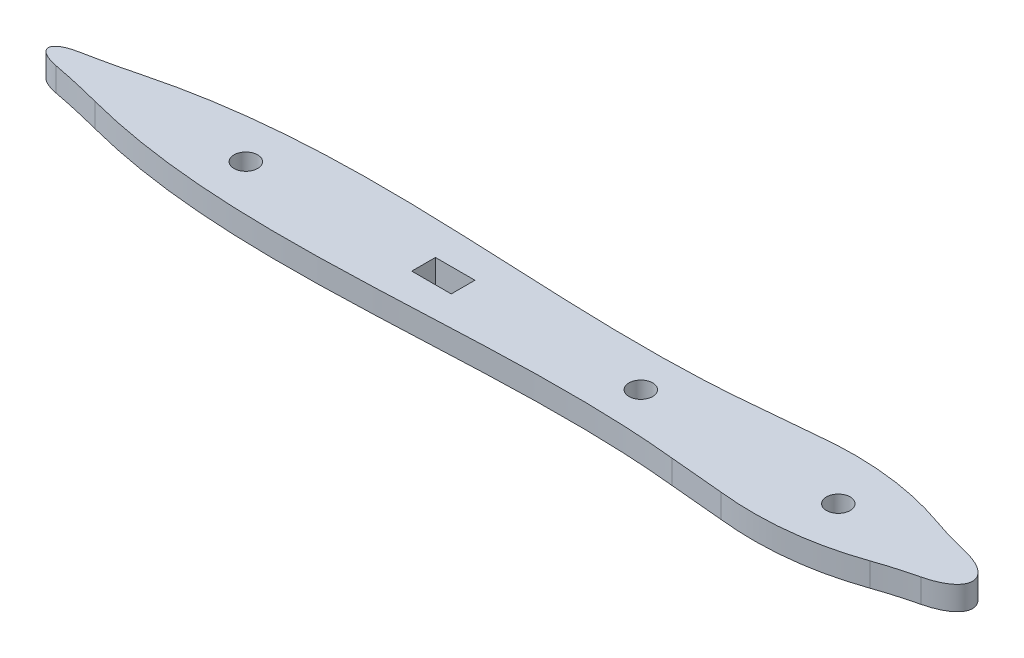
ISO-10303-21;
HEADER;
FILE_DESCRIPTION(('STEP AP214'),'2;1');
FILE_NAME('part.step','',(''),(''),'','','');
FILE_SCHEMA(('AUTOMOTIVE_DESIGN { 1 0 10303 214 1 1 1 1 }'));
ENDSEC;
DATA;
#1=APPLICATION_CONTEXT('core data for automotive mechanical design processes');
#2=APPLICATION_PROTOCOL_DEFINITION('international standard','automotive_design',2000,#1);
#3=PRODUCT_CONTEXT('',#1,'mechanical');
#4=PRODUCT('Part','Part','',(#3));
#5=PRODUCT_RELATED_PRODUCT_CATEGORY('part','',(#4));
#6=PRODUCT_DEFINITION_FORMATION('','',#4);
#7=PRODUCT_DEFINITION_CONTEXT('part definition',#1,'design');
#8=PRODUCT_DEFINITION('design','',#6,#7);
#9=PRODUCT_DEFINITION_SHAPE('','',#8);
#10=(LENGTH_UNIT() NAMED_UNIT(*) SI_UNIT(.MILLI.,.METRE.));
#11=(NAMED_UNIT(*) PLANE_ANGLE_UNIT() SI_UNIT($,.RADIAN.));
#12=(NAMED_UNIT(*) SI_UNIT($,.STERADIAN.) SOLID_ANGLE_UNIT());
#13=UNCERTAINTY_MEASURE_WITH_UNIT(LENGTH_MEASURE(1.E-05),#10,'distance_accuracy_value','');
#14=(GEOMETRIC_REPRESENTATION_CONTEXT(3) GLOBAL_UNCERTAINTY_ASSIGNED_CONTEXT((#13)) GLOBAL_UNIT_ASSIGNED_CONTEXT((#10,
#11,#12)) REPRESENTATION_CONTEXT('',''));
#15=CARTESIAN_POINT('',(0.,0.,0.));
#16=DIRECTION('',(0.,0.,1.));
#17=DIRECTION('',(1.,0.,0.));
#18=AXIS2_PLACEMENT_3D('',#15,#16,#17);
#19=CARTESIAN_POINT('',(0.,3.,-1.50000000000007));
#20=DIRECTION('',(0.,0.,1.));
#21=DIRECTION('',(1.,0.,0.));
#22=AXIS2_PLACEMENT_3D('',#19,#20,#21);
#23=PLANE('',#22);
#24=DIRECTION('',(-1.,0.,0.));
#25=VECTOR('',#24,1.);
#26=CARTESIAN_POINT('',(0.,0.,-1.50000000000007));
#27=LINE('',#26,#25);
#28=CARTESIAN_POINT('',(-47.5,0.,-1.50000000000007));
#29=VERTEX_POINT('',#28);
#30=CARTESIAN_POINT('',(-52.5,0.,-1.50000000000007));
#31=VERTEX_POINT('',#30);
#32=EDGE_CURVE('E249',#29,#31,#27,.T.);
#33=ORIENTED_EDGE('',*,*,#32,.F.);
#34=DIRECTION('',(0.,-1.,0.));
#35=VECTOR('',#34,1.);
#36=CARTESIAN_POINT('',(-47.5,3.,-1.50000000000007));
#37=LINE('',#36,#35);
#38=CARTESIAN_POINT('',(-47.5,3.,-1.50000000000007));
#39=VERTEX_POINT('',#38);
#40=EDGE_CURVE('E11',#39,#29,#37,.T.);
#41=ORIENTED_EDGE('',*,*,#40,.F.);
#42=DIRECTION('',(-1.,0.,0.));
#43=VECTOR('',#42,1.);
#44=CARTESIAN_POINT('',(0.,3.,-1.50000000000007));
#45=LINE('',#44,#43);
#46=CARTESIAN_POINT('',(-52.5,3.,-1.50000000000007));
#47=VERTEX_POINT('',#46);
#48=EDGE_CURVE('E175',#39,#47,#45,.T.);
#49=ORIENTED_EDGE('',*,*,#48,.T.);
#50=DIRECTION('',(0.,-1.,0.));
#51=VECTOR('',#50,1.);
#52=CARTESIAN_POINT('',(-52.5,3.,-1.50000000000007));
#53=LINE('',#52,#51);
#54=EDGE_CURVE('E59',#47,#31,#53,.T.);
#55=ORIENTED_EDGE('',*,*,#54,.T.);
#56=EDGE_LOOP('',(#33,#41,#49,#55));
#57=FACE_BOUND('',#56,.T.);
#58=ADVANCED_FACE('F40',(#57),#23,.T.);
#59=CARTESIAN_POINT('',(-47.5,3.,0.));
#60=DIRECTION('',(-1.,0.,0.));
#61=DIRECTION('',(0.,0.,1.));
#62=AXIS2_PLACEMENT_3D('',#59,#60,#61);
#63=PLANE('',#62);
#64=DIRECTION('',(0.,0.,-1.));
#65=VECTOR('',#64,1.);
#66=CARTESIAN_POINT('',(-47.5,0.,0.));
#67=LINE('',#66,#65);
#68=CARTESIAN_POINT('',(-47.5,0.,1.50000000000001));
#69=VERTEX_POINT('',#68);
#70=EDGE_CURVE('E164',#69,#29,#67,.T.);
#71=ORIENTED_EDGE('',*,*,#70,.F.);
#72=DIRECTION('',(0.,-1.,0.));
#73=VECTOR('',#72,1.);
#74=CARTESIAN_POINT('',(-47.5,3.,1.50000000000001));
#75=LINE('',#74,#73);
#76=CARTESIAN_POINT('',(-47.5,3.,1.50000000000001));
#77=VERTEX_POINT('',#76);
#78=EDGE_CURVE('E50',#77,#69,#75,.T.);
#79=ORIENTED_EDGE('',*,*,#78,.F.);
#80=DIRECTION('',(0.,0.,-1.));
#81=VECTOR('',#80,1.);
#82=CARTESIAN_POINT('',(-47.5,3.,0.));
#83=LINE('',#82,#81);
#84=EDGE_CURVE('E162',#77,#39,#83,.T.);
#85=ORIENTED_EDGE('',*,*,#84,.T.);
#86=ORIENTED_EDGE('',*,*,#40,.T.);
#87=EDGE_LOOP('',(#71,#79,#85,#86));
#88=FACE_BOUND('',#87,.T.);
#89=ADVANCED_FACE('F161',(#88),#63,.T.);
#90=CARTESIAN_POINT('',(0.,3.,1.50000000000001));
#91=DIRECTION('',(0.,0.,-1.));
#92=DIRECTION('',(-1.,0.,0.));
#93=AXIS2_PLACEMENT_3D('',#90,#91,#92);
#94=PLANE('',#93);
#95=DIRECTION('',(1.,0.,0.));
#96=VECTOR('',#95,1.);
#97=CARTESIAN_POINT('',(0.,0.,1.50000000000001));
#98=LINE('',#97,#96);
#99=CARTESIAN_POINT('',(-52.5,0.,1.50000000000001));
#100=VERTEX_POINT('',#99);
#101=EDGE_CURVE('E252',#100,#69,#98,.T.);
#102=ORIENTED_EDGE('',*,*,#101,.F.);
#103=DIRECTION('',(0.,-1.,0.));
#104=VECTOR('',#103,1.);
#105=CARTESIAN_POINT('',(-52.5,3.,1.50000000000001));
#106=LINE('',#105,#104);
#107=CARTESIAN_POINT('',(-52.5,3.,1.50000000000001));
#108=VERTEX_POINT('',#107);
#109=EDGE_CURVE('E108',#108,#100,#106,.T.);
#110=ORIENTED_EDGE('',*,*,#109,.F.);
#111=DIRECTION('',(1.,0.,0.));
#112=VECTOR('',#111,1.);
#113=CARTESIAN_POINT('',(0.,3.,1.50000000000001));
#114=LINE('',#113,#112);
#115=EDGE_CURVE('E174',#108,#77,#114,.T.);
#116=ORIENTED_EDGE('',*,*,#115,.T.);
#117=ORIENTED_EDGE('',*,*,#78,.T.);
#118=EDGE_LOOP('',(#102,#110,#116,#117));
#119=FACE_BOUND('',#118,.T.);
#120=ADVANCED_FACE('F177',(#119),#94,.T.);
#121=CARTESIAN_POINT('',(8.2697237420884,3.,4.25946897668879));
#122=CARTESIAN_POINT('',(2.83491324274515,3.,6.15734876027867));
#123=CARTESIAN_POINT('',(-2.82215392505471,3.,6.78752581668375));
#124=CARTESIAN_POINT('',(-8.7014778224339,3.,6.14999999999991));
#125=B_SPLINE_CURVE_WITH_KNOTS('',3,(#121,#122,#123,#124),.UNSPECIFIED.,.F.,.F.,(4,4),
(0.353889440275628,1.),.UNSPECIFIED.);
#126=DIRECTION('',(0.,-1.,0.));
#127=VECTOR('',#126,1.);
#128=SURFACE_OF_LINEAR_EXTRUSION('',#125,#127);
#129=CARTESIAN_POINT('',(8.2697237420884,0.,4.25946897668879));
#130=CARTESIAN_POINT('',(2.83491324274515,0.,6.15734876027867));
#131=CARTESIAN_POINT('',(-2.82215392505471,0.,6.78752581668375));
#132=CARTESIAN_POINT('',(-8.7014778224339,0.,6.14999999999991));
#133=B_SPLINE_CURVE_WITH_KNOTS('',3,(#129,#130,#131,#132),.UNSPECIFIED.,.F.,.F.,(4,4),
(0.353889440275628,1.),.UNSPECIFIED.);
#134=CARTESIAN_POINT('',(8.2697237420884,0.,4.25946897668879));
#135=VERTEX_POINT('',#134);
#136=CARTESIAN_POINT('',(-8.7014778224339,0.,6.14999999999991));
#137=VERTEX_POINT('',#136);
#138=EDGE_CURVE('E187',#135,#137,#133,.T.);
#139=ORIENTED_EDGE('',*,*,#138,.F.);
#140=DIRECTION('',(0.,-1.,0.));
#141=VECTOR('',#140,1.);
#142=CARTESIAN_POINT('',(8.2697237420884,3.,4.25946897668879));
#143=LINE('',#142,#141);
#144=CARTESIAN_POINT('',(8.2697237420884,3.,4.25946897668879));
#145=VERTEX_POINT('',#144);
#146=EDGE_CURVE('E44',#145,#135,#143,.T.);
#147=ORIENTED_EDGE('',*,*,#146,.F.);
#148=CARTESIAN_POINT('',(-8.7014778224339,3.,6.14999999999991));
#149=VERTEX_POINT('',#148);
#150=EDGE_CURVE('E297',#145,#149,#125,.T.);
#151=ORIENTED_EDGE('',*,*,#150,.T.);
#152=DIRECTION('',(0.,-1.,0.));
#153=VECTOR('',#152,1.);
#154=CARTESIAN_POINT('',(-8.7014778224339,3.,6.14999999999991));
#155=LINE('',#154,#153);
#156=EDGE_CURVE('E180',#149,#137,#155,.T.);
#157=ORIENTED_EDGE('',*,*,#156,.T.);
#158=EDGE_LOOP('',(#139,#147,#151,#157));
#159=FACE_BOUND('',#158,.T.);
#160=ADVANCED_FACE('F296',(#159),#128,.T.);
#161=CARTESIAN_POINT('',(24.753938545321,3.,51.4640308570935));
#162=DIRECTION('',(0.,-1.,0.));
#163=DIRECTION('',(0.,0.,-1.));
#164=AXIS2_PLACEMENT_3D('',#161,#162,#163);
#165=CYLINDRICAL_SURFACE('',#164,50.0000000000007);
#166=CARTESIAN_POINT('',(24.753938545321,0.,51.4640308570935));
#167=DIRECTION('',(0.,1.,0.));
#168=DIRECTION('',(0.,0.,1.));
#169=AXIS2_PLACEMENT_3D('',#166,#167,#168);
#170=CIRCLE('',#169,50.0000000000007);
#171=CARTESIAN_POINT('',(13.2431532591674,0.,2.80704963038625));
#172=VERTEX_POINT('',#171);
#173=EDGE_CURVE('E192',#135,#172,#170,.F.);
#174=ORIENTED_EDGE('',*,*,#173,.T.);
#175=DIRECTION('',(0.,-1.,0.));
#176=VECTOR('',#175,1.);
#177=CARTESIAN_POINT('',(13.2431532591674,3.,2.80704963038625));
#178=LINE('',#177,#176);
#179=CARTESIAN_POINT('',(13.2431532591674,3.,2.80704963038625));
#180=VERTEX_POINT('',#179);
#181=EDGE_CURVE('E282',#180,#172,#178,.T.);
#182=ORIENTED_EDGE('',*,*,#181,.F.);
#183=CARTESIAN_POINT('',(24.753938545321,3.,51.4640308570935));
#184=DIRECTION('',(0.,1.,0.));
#185=DIRECTION('',(0.,0.,1.));
#186=AXIS2_PLACEMENT_3D('',#183,#184,#185);
#187=CIRCLE('',#186,50.0000000000007);
#188=EDGE_CURVE('E290',#145,#180,#187,.F.);
#189=ORIENTED_EDGE('',*,*,#188,.F.);
#190=ORIENTED_EDGE('',*,*,#146,.T.);
#191=EDGE_LOOP('',(#174,#182,#189,#190));
#192=FACE_BOUND('',#191,.T.);
#193=ADVANCED_FACE('F288',(#192),#165,.F.);
#194=CARTESIAN_POINT('',(10.0000045781328,3.,-7.43034571371037E-07));
#195=DIRECTION('',(0.,1.,0.));
#196=DIRECTION('',(1.,0.,0.));
#197=AXIS2_PLACEMENT_3D('',#194,#195,#196);
#198=ELLIPSE('',#197,6.99999866487509,3.16752117407591);
#199=DIRECTION('',(0.,-1.,0.));
#200=VECTOR('',#199,1.);
#201=SURFACE_OF_LINEAR_EXTRUSION('',#198,#200);
#202=CARTESIAN_POINT('',(10.0000045781328,0.,-7.43034571371037E-07));
#203=DIRECTION('',(0.,1.,0.));
#204=DIRECTION('',(1.,0.,0.));
#205=AXIS2_PLACEMENT_3D('',#202,#203,#204);
#206=ELLIPSE('',#205,6.99999866487509,3.16752117407591);
#207=CARTESIAN_POINT('',(13.2431507603538,0.,-2.80705170759964));
#208=VERTEX_POINT('',#207);
#209=EDGE_CURVE('E198',#172,#208,#206,.T.);
#210=ORIENTED_EDGE('',*,*,#209,.T.);
#211=DIRECTION('',(0.,-1.,0.));
#212=VECTOR('',#211,1.);
#213=CARTESIAN_POINT('',(13.2431507603538,3.,-2.80705170759964));
#214=LINE('',#213,#212);
#215=CARTESIAN_POINT('',(13.2431507603538,3.,-2.80705170759964));
#216=VERTEX_POINT('',#215);
#217=EDGE_CURVE('E280',#216,#208,#214,.T.);
#218=ORIENTED_EDGE('',*,*,#217,.F.);
#219=EDGE_CURVE('E420',#180,#216,#198,.T.);
#220=ORIENTED_EDGE('',*,*,#219,.F.);
#221=ORIENTED_EDGE('',*,*,#181,.T.);
#222=EDGE_LOOP('',(#210,#218,#220,#221));
#223=FACE_BOUND('',#222,.T.);
#224=ADVANCED_FACE('F346',(#223),#201,.F.);
#225=CARTESIAN_POINT('',(24.7539253519989,3.,-51.4640354643056));
#226=DIRECTION('',(0.,-1.,0.));
#227=DIRECTION('',(0.,0.,-1.));
#228=AXIS2_PLACEMENT_3D('',#225,#226,#227);
#229=CYLINDRICAL_SURFACE('',#228,50.0000000000001);
#230=CARTESIAN_POINT('',(24.7539253519989,0.,-51.4640354643056));
#231=DIRECTION('',(0.,1.,0.));
#232=DIRECTION('',(0.,0.,1.));
#233=AXIS2_PLACEMENT_3D('',#230,#231,#232);
#234=CIRCLE('',#233,50.0000000000001);
#235=CARTESIAN_POINT('',(8.26972374208836,0.,-4.25946897668882));
#236=VERTEX_POINT('',#235);
#237=EDGE_CURVE('E201',#208,#236,#234,.F.);
#238=ORIENTED_EDGE('',*,*,#237,.T.);
#239=DIRECTION('',(0.,-1.,0.));
#240=VECTOR('',#239,1.);
#241=CARTESIAN_POINT('',(8.26972374208836,3.,-4.25946897668882));
#242=LINE('',#241,#240);
#243=CARTESIAN_POINT('',(8.26972374208836,3.,-4.25946897668882));
#244=VERTEX_POINT('',#243);
#245=EDGE_CURVE('E277',#244,#236,#242,.T.);
#246=ORIENTED_EDGE('',*,*,#245,.F.);
#247=CARTESIAN_POINT('',(24.7539253519989,3.,-51.4640354643056));
#248=DIRECTION('',(0.,1.,0.));
#249=DIRECTION('',(0.,0.,1.));
#250=AXIS2_PLACEMENT_3D('',#247,#248,#249);
#251=CIRCLE('',#250,50.0000000000001);
#252=EDGE_CURVE('E344',#216,#244,#251,.F.);
#253=ORIENTED_EDGE('',*,*,#252,.F.);
#254=ORIENTED_EDGE('',*,*,#217,.T.);
#255=EDGE_LOOP('',(#238,#246,#253,#254));
#256=FACE_BOUND('',#255,.T.);
#257=ADVANCED_FACE('F342',(#256),#229,.F.);
#258=CARTESIAN_POINT('',(8.26972374208834,3.,-4.25946897668882));
#259=CARTESIAN_POINT('',(2.83491271348361,3.,-6.15734724087725));
#260=CARTESIAN_POINT('',(-2.82215338962121,3.,-6.78752735380361));
#261=CARTESIAN_POINT('',(-8.7014778224339,3.,-6.14999999999991));
#262=B_SPLINE_CURVE_WITH_KNOTS('',3,(#258,#259,#260,#261),.UNSPECIFIED.,.F.,.F.,(4,4),
(0.353889440275629,1.),.UNSPECIFIED.);
#263=DIRECTION('',(0.,-1.,0.));
#264=VECTOR('',#263,1.);
#265=SURFACE_OF_LINEAR_EXTRUSION('',#262,#264);
#266=CARTESIAN_POINT('',(8.26972374208834,0.,-4.25946897668882));
#267=CARTESIAN_POINT('',(2.83491271348361,0.,-6.15734724087725));
#268=CARTESIAN_POINT('',(-2.82215338962121,0.,-6.78752735380361));
#269=CARTESIAN_POINT('',(-8.7014778224339,0.,-6.14999999999991));
#270=B_SPLINE_CURVE_WITH_KNOTS('',3,(#266,#267,#268,#269),.UNSPECIFIED.,.F.,.F.,(4,4),
(0.353889440275629,1.),.UNSPECIFIED.);
#271=CARTESIAN_POINT('',(-8.7014778224339,0.,-6.1499999999999));
#272=VERTEX_POINT('',#271);
#273=EDGE_CURVE('E204',#236,#272,#270,.T.);
#274=ORIENTED_EDGE('',*,*,#273,.T.);
#275=DIRECTION('',(0.,-1.,0.));
#276=VECTOR('',#275,1.);
#277=CARTESIAN_POINT('',(-8.7014778224339,3.,-6.1499999999999));
#278=LINE('',#277,#276);
#279=CARTESIAN_POINT('',(-8.7014778224339,3.,-6.1499999999999));
#280=VERTEX_POINT('',#279);
#281=EDGE_CURVE('E275',#280,#272,#278,.T.);
#282=ORIENTED_EDGE('',*,*,#281,.F.);
#283=EDGE_CURVE('E339',#244,#280,#262,.T.);
#284=ORIENTED_EDGE('',*,*,#283,.F.);
#285=ORIENTED_EDGE('',*,*,#245,.T.);
#286=EDGE_LOOP('',(#274,#282,#284,#285));
#287=FACE_BOUND('',#286,.T.);
#288=ADVANCED_FACE('F337',(#287),#265,.F.);
#289=CARTESIAN_POINT('',(-0.628159630564511,3.,-6.88642461198353));
#290=DIRECTION('',(-0.0908399557754639,0.,-0.995865504189553));
#291=DIRECTION('',(-0.995865504189553,0.,0.0908399557754639));
#292=AXIS2_PLACEMENT_3D('',#289,#290,#291);
#293=PLANE('',#292);
#294=DIRECTION('',(0.995865504189553,0.,-0.0908399557754639));
#295=VECTOR('',#294,1.);
#296=CARTESIAN_POINT('',(-0.628159630564511,0.,-6.88642461198353));
#297=LINE('',#296,#295);
#298=CARTESIAN_POINT('',(-15.53242609968,0.,-5.52690075939059));
#299=VERTEX_POINT('',#298);
#300=EDGE_CURVE('E209',#299,#272,#297,.T.);
#301=ORIENTED_EDGE('',*,*,#300,.F.);
#302=DIRECTION('',(0.,-1.,0.));
#303=VECTOR('',#302,1.);
#304=CARTESIAN_POINT('',(-15.53242609968,3.,-5.52690075939059));
#305=LINE('',#304,#303);
#306=CARTESIAN_POINT('',(-15.53242609968,3.,-5.52690075939059));
#307=VERTEX_POINT('',#306);
#308=EDGE_CURVE('E273',#307,#299,#305,.T.);
#309=ORIENTED_EDGE('',*,*,#308,.F.);
#310=DIRECTION('',(0.995865504189553,0.,-0.0908399557754639));
#311=VECTOR('',#310,1.);
#312=CARTESIAN_POINT('',(-0.628159630564511,3.,-6.88642461198353));
#313=LINE('',#312,#311);
#314=EDGE_CURVE('E335',#307,#280,#313,.T.);
#315=ORIENTED_EDGE('',*,*,#314,.T.);
#316=ORIENTED_EDGE('',*,*,#281,.T.);
#317=EDGE_LOOP('',(#301,#309,#315,#316));
#318=FACE_BOUND('',#317,.T.);
#319=ADVANCED_FACE('F331',(#318),#293,.T.);
#320=CARTESIAN_POINT('',(-91.1354786617069,3.,-2.9393564152006));
#321=CARTESIAN_POINT('',(-85.8147090714331,3.,-4.33037882663589));
#322=CARTESIAN_POINT('',(-60.9175612267895,3.,-7.97508815960082));
#323=CARTESIAN_POINT('',(-35.1324327133064,3.,-3.48955228013344));
#324=CARTESIAN_POINT('',(-15.53242609968,3.,-5.52690075939059));
#325=B_SPLINE_CURVE_WITH_KNOTS('',3,(#320,#321,#322,#323,#324),.UNSPECIFIED.,.F.,.F.,(4,1,4),
(0.107974897642307,0.300967180896954,1.),.UNSPECIFIED.);
#326=DIRECTION('',(0.,-1.,0.));
#327=VECTOR('',#326,1.);
#328=SURFACE_OF_LINEAR_EXTRUSION('',#325,#327);
#329=CARTESIAN_POINT('',(-91.1354786617069,0.,-2.9393564152006));
#330=CARTESIAN_POINT('',(-85.8147090714331,0.,-4.33037882663589));
#331=CARTESIAN_POINT('',(-60.9175612267895,0.,-7.97508815960082));
#332=CARTESIAN_POINT('',(-35.1324327133064,0.,-3.48955228013344));
#333=CARTESIAN_POINT('',(-15.53242609968,0.,-5.52690075939059));
#334=B_SPLINE_CURVE_WITH_KNOTS('',3,(#329,#330,#331,#332,#333),.UNSPECIFIED.,.F.,.F.,(4,1,4),
(0.107974897642307,0.300967180896954,1.),.UNSPECIFIED.);
#335=CARTESIAN_POINT('',(-91.1354786617069,0.,-2.9393564152006));
#336=VERTEX_POINT('',#335);
#337=EDGE_CURVE('E215',#336,#299,#334,.T.);
#338=ORIENTED_EDGE('',*,*,#337,.F.);
#339=DIRECTION('',(0.,-1.,0.));
#340=VECTOR('',#339,1.);
#341=CARTESIAN_POINT('',(-91.1354786617069,3.,-2.9393564152006));
#342=LINE('',#341,#340);
#343=CARTESIAN_POINT('',(-91.1354786617069,3.,-2.9393564152006));
#344=VERTEX_POINT('',#343);
#345=EDGE_CURVE('E271',#344,#336,#342,.T.);
#346=ORIENTED_EDGE('',*,*,#345,.F.);
#347=EDGE_CURVE('E438',#344,#307,#325,.T.);
#348=ORIENTED_EDGE('',*,*,#347,.T.);
#349=ORIENTED_EDGE('',*,*,#308,.T.);
#350=EDGE_LOOP('',(#338,#346,#348,#349));
#351=FACE_BOUND('',#350,.T.);
#352=ADVANCED_FACE('F328',(#351),#328,.T.);
#353=CARTESIAN_POINT('',(-116.428663075589,3.,-99.6877663360121));
#354=DIRECTION('',(0.,-1.,0.));
#355=DIRECTION('',(0.,0.,-1.));
#356=AXIS2_PLACEMENT_3D('',#353,#354,#355);
#357=CYLINDRICAL_SURFACE('',#356,100.);
#358=CARTESIAN_POINT('',(-116.428663075589,0.,-99.6877663360121));
#359=DIRECTION('',(0.,1.,0.));
#360=DIRECTION('',(0.,0.,1.));
#361=AXIS2_PLACEMENT_3D('',#358,#359,#360);
#362=CIRCLE('',#361,100.);
#363=CARTESIAN_POINT('',(-97.5494712931568,0.,-1.48605495763457));
#364=VERTEX_POINT('',#363);
#365=EDGE_CURVE('E220',#364,#336,#362,.T.);
#366=ORIENTED_EDGE('',*,*,#365,.F.);
#367=DIRECTION('',(0.,-1.,0.));
#368=VECTOR('',#367,1.);
#369=CARTESIAN_POINT('',(-97.5494712931568,3.,-1.48605495763457));
#370=LINE('',#369,#368);
#371=CARTESIAN_POINT('',(-97.5494712931568,3.,-1.48605495763457));
#372=VERTEX_POINT('',#371);
#373=EDGE_CURVE('E269',#372,#364,#370,.T.);
#374=ORIENTED_EDGE('',*,*,#373,.F.);
#375=CARTESIAN_POINT('',(-116.428663075589,3.,-99.6877663360121));
#376=DIRECTION('',(0.,1.,0.));
#377=DIRECTION('',(0.,0.,1.));
#378=AXIS2_PLACEMENT_3D('',#375,#376,#377);
#379=CIRCLE('',#378,100.);
#380=EDGE_CURVE('E324',#372,#344,#379,.T.);
#381=ORIENTED_EDGE('',*,*,#380,.T.);
#382=ORIENTED_EDGE('',*,*,#345,.T.);
#383=EDGE_LOOP('',(#366,#374,#381,#382));
#384=FACE_BOUND('',#383,.T.);
#385=ADVANCED_FACE('F320',(#384),#357,.F.);
#386=CARTESIAN_POINT('',(-95.4266181455895,3.,0.));
#387=DIRECTION('',(0.,1.,0.));
#388=DIRECTION('',(-1.,0.,0.));
#389=AXIS2_PLACEMENT_3D('',#386,#387,#388);
#390=ELLIPSE('',#389,4.5733818544105,1.67774940956735);
#391=DIRECTION('',(0.,-1.,0.));
#392=VECTOR('',#391,1.);
#393=SURFACE_OF_LINEAR_EXTRUSION('',#390,#392);
#394=CARTESIAN_POINT('',(-95.4266181455895,0.,0.));
#395=DIRECTION('',(0.,1.,0.));
#396=DIRECTION('',(-1.,0.,0.));
#397=AXIS2_PLACEMENT_3D('',#394,#395,#396);
#398=ELLIPSE('',#397,4.5733818544105,1.67774940956735);
#399=CARTESIAN_POINT('',(-97.5494712931573,0.,1.4860549576345));
#400=VERTEX_POINT('',#399);
#401=EDGE_CURVE('E226',#364,#400,#398,.T.);
#402=ORIENTED_EDGE('',*,*,#401,.T.);
#403=DIRECTION('',(0.,-1.,0.));
#404=VECTOR('',#403,1.);
#405=CARTESIAN_POINT('',(-97.5494712931573,3.,1.4860549576345));
#406=LINE('',#405,#404);
#407=CARTESIAN_POINT('',(-97.5494712931573,3.,1.4860549576345));
#408=VERTEX_POINT('',#407);
#409=EDGE_CURVE('E266',#408,#400,#406,.T.);
#410=ORIENTED_EDGE('',*,*,#409,.F.);
#411=EDGE_CURVE('E446',#372,#408,#390,.T.);
#412=ORIENTED_EDGE('',*,*,#411,.F.);
#413=ORIENTED_EDGE('',*,*,#373,.T.);
#414=EDGE_LOOP('',(#402,#410,#412,#413));
#415=FACE_BOUND('',#414,.T.);
#416=ADVANCED_FACE('F317',(#415),#393,.F.);
#417=CARTESIAN_POINT('',(-116.428663075595,3.,99.6877663360108));
#418=DIRECTION('',(0.,-1.,0.));
#419=DIRECTION('',(0.,0.,-1.));
#420=AXIS2_PLACEMENT_3D('',#417,#418,#419);
#421=CYLINDRICAL_SURFACE('',#420,100.);
#422=CARTESIAN_POINT('',(-116.428663075595,0.,99.6877663360108));
#423=DIRECTION('',(0.,1.,0.));
#424=DIRECTION('',(0.,0.,1.));
#425=AXIS2_PLACEMENT_3D('',#422,#423,#424);
#426=CIRCLE('',#425,100.);
#427=CARTESIAN_POINT('',(-91.1354786617065,0.,2.9393564152012));
#428=VERTEX_POINT('',#427);
#429=EDGE_CURVE('E229',#400,#428,#426,.F.);
#430=ORIENTED_EDGE('',*,*,#429,.T.);
#431=DIRECTION('',(0.,-1.,0.));
#432=VECTOR('',#431,1.);
#433=CARTESIAN_POINT('',(-91.1354786617065,3.,2.9393564152012));
#434=LINE('',#433,#432);
#435=CARTESIAN_POINT('',(-91.1354786617065,3.,2.9393564152012));
#436=VERTEX_POINT('',#435);
#437=EDGE_CURVE('E263',#436,#428,#434,.T.);
#438=ORIENTED_EDGE('',*,*,#437,.F.);
#439=CARTESIAN_POINT('',(-116.428663075595,3.,99.6877663360108));
#440=DIRECTION('',(0.,1.,0.));
#441=DIRECTION('',(0.,0.,1.));
#442=AXIS2_PLACEMENT_3D('',#439,#440,#441);
#443=CIRCLE('',#442,100.);
#444=EDGE_CURVE('E313',#408,#436,#443,.F.);
#445=ORIENTED_EDGE('',*,*,#444,.F.);
#446=ORIENTED_EDGE('',*,*,#409,.T.);
#447=EDGE_LOOP('',(#430,#438,#445,#446));
#448=FACE_BOUND('',#447,.T.);
#449=ADVANCED_FACE('F311',(#448),#421,.F.);
#450=CARTESIAN_POINT('',(-91.1354786617065,3.,2.93935641520122));
#451=CARTESIAN_POINT('',(-85.8147090714319,3.,4.33037882663711));
#452=CARTESIAN_POINT('',(-60.9175612268035,3.,7.97508815959745));
#453=CARTESIAN_POINT('',(-35.1324327132966,3.,3.4895522801366));
#454=CARTESIAN_POINT('',(-15.53242609968,3.,5.5269007593906));
#455=B_SPLINE_CURVE_WITH_KNOTS('',3,(#450,#451,#452,#453,#454),.UNSPECIFIED.,.F.,.F.,(4,1,4),
(0.107974897642226,0.300967180896954,1.),.UNSPECIFIED.);
#456=DIRECTION('',(0.,-1.,0.));
#457=VECTOR('',#456,1.);
#458=SURFACE_OF_LINEAR_EXTRUSION('',#455,#457);
#459=CARTESIAN_POINT('',(-91.1354786617065,0.,2.93935641520122));
#460=CARTESIAN_POINT('',(-85.8147090714319,0.,4.33037882663711));
#461=CARTESIAN_POINT('',(-60.9175612268035,0.,7.97508815959745));
#462=CARTESIAN_POINT('',(-35.1324327132966,0.,3.4895522801366));
#463=CARTESIAN_POINT('',(-15.53242609968,0.,5.5269007593906));
#464=B_SPLINE_CURVE_WITH_KNOTS('',3,(#459,#460,#461,#462,#463),.UNSPECIFIED.,.F.,.F.,(4,1,4),
(0.107974897642226,0.300967180896954,1.),.UNSPECIFIED.);
#465=CARTESIAN_POINT('',(-15.53242609968,0.,5.5269007593906));
#466=VERTEX_POINT('',#465);
#467=EDGE_CURVE('E232',#428,#466,#464,.T.);
#468=ORIENTED_EDGE('',*,*,#467,.T.);
#469=DIRECTION('',(0.,-1.,0.));
#470=VECTOR('',#469,1.);
#471=CARTESIAN_POINT('',(-15.53242609968,3.,5.5269007593906));
#472=LINE('',#471,#470);
#473=CARTESIAN_POINT('',(-15.53242609968,3.,5.5269007593906));
#474=VERTEX_POINT('',#473);
#475=EDGE_CURVE('E261',#474,#466,#472,.T.);
#476=ORIENTED_EDGE('',*,*,#475,.F.);
#477=EDGE_CURVE('E308',#436,#474,#455,.T.);
#478=ORIENTED_EDGE('',*,*,#477,.F.);
#479=ORIENTED_EDGE('',*,*,#437,.T.);
#480=EDGE_LOOP('',(#468,#476,#478,#479));
#481=FACE_BOUND('',#480,.T.);
#482=ADVANCED_FACE('F307',(#481),#458,.F.);
#483=CARTESIAN_POINT('',(-75.,3.,0.));
#484=DIRECTION('',(0.,-1.,0.));
#485=DIRECTION('',(0.,0.,-1.));
#486=AXIS2_PLACEMENT_3D('',#483,#484,#485);
#487=CYLINDRICAL_SURFACE('',#486,1.5);
#488=CARTESIAN_POINT('',(-75.,3.,0.));
#489=DIRECTION('',(0.,1.,0.));
#490=DIRECTION('',(0.,0.,1.));
#491=AXIS2_PLACEMENT_3D('',#488,#489,#490);
#492=CIRCLE('',#491,1.5);
#493=CARTESIAN_POINT('',(-75.,3.,1.50000000000001));
#494=VERTEX_POINT('',#493);
#495=EDGE_CURVE('E391',#494,#494,#492,.T.);
#496=ORIENTED_EDGE('',*,*,#495,.T.);
#497=EDGE_LOOP('',(#496));
#498=FACE_BOUND('',#497,.T.);
#499=CARTESIAN_POINT('',(-75.,0.,0.));
#500=DIRECTION('',(0.,1.,0.));
#501=DIRECTION('',(0.,0.,1.));
#502=AXIS2_PLACEMENT_3D('',#499,#500,#501);
#503=CIRCLE('',#502,1.5);
#504=CARTESIAN_POINT('',(-75.,0.,1.50000000000001));
#505=VERTEX_POINT('',#504);
#506=EDGE_CURVE('E246',#505,#505,#503,.T.);
#507=ORIENTED_EDGE('',*,*,#506,.F.);
#508=EDGE_LOOP('',(#507));
#509=FACE_BOUND('',#508,.T.);
#510=ADVANCED_FACE('F364',(#498,#509),#487,.F.);
#511=CARTESIAN_POINT('',(-25.,3.,0.));
#512=DIRECTION('',(0.,-1.,0.));
#513=DIRECTION('',(0.,0.,-1.));
#514=AXIS2_PLACEMENT_3D('',#511,#512,#513);
#515=CYLINDRICAL_SURFACE('',#514,1.5);
#516=CARTESIAN_POINT('',(-25.,3.,0.));
#517=DIRECTION('',(0.,1.,0.));
#518=DIRECTION('',(0.,0.,1.));
#519=AXIS2_PLACEMENT_3D('',#516,#517,#518);
#520=CIRCLE('',#519,1.5);
#521=CARTESIAN_POINT('',(-25.,3.,1.5));
#522=VERTEX_POINT('',#521);
#523=EDGE_CURVE('E388',#522,#522,#520,.T.);
#524=ORIENTED_EDGE('',*,*,#523,.T.);
#525=EDGE_LOOP('',(#524));
#526=FACE_BOUND('',#525,.T.);
#527=CARTESIAN_POINT('',(-25.,0.,0.));
#528=DIRECTION('',(0.,1.,0.));
#529=DIRECTION('',(0.,0.,1.));
#530=AXIS2_PLACEMENT_3D('',#527,#528,#529);
#531=CIRCLE('',#530,1.5);
#532=CARTESIAN_POINT('',(-25.,0.,1.5));
#533=VERTEX_POINT('',#532);
#534=EDGE_CURVE('E243',#533,#533,#531,.T.);
#535=ORIENTED_EDGE('',*,*,#534,.F.);
#536=EDGE_LOOP('',(#535));
#537=FACE_BOUND('',#536,.T.);
#538=ADVANCED_FACE('F367',(#526,#537),#515,.F.);
#539=CARTESIAN_POINT('',(-0.628159630564506,3.,6.88642461198352));
#540=DIRECTION('',(-0.0908399557754633,0.,0.995865504189553));
#541=DIRECTION('',(0.995865504189553,0.,0.0908399557754633));
#542=AXIS2_PLACEMENT_3D('',#539,#540,#541);
#543=PLANE('',#542);
#544=DIRECTION('',(-0.995865504189553,0.,-0.0908399557754633));
#545=VECTOR('',#544,1.);
#546=CARTESIAN_POINT('',(-0.628159630564506,0.,6.88642461198352));
#547=LINE('',#546,#545);
#548=EDGE_CURVE('E237',#137,#466,#547,.T.);
#549=ORIENTED_EDGE('',*,*,#548,.F.);
#550=ORIENTED_EDGE('',*,*,#156,.F.);
#551=DIRECTION('',(-0.995865504189553,0.,-0.0908399557754633));
#552=VECTOR('',#551,1.);
#553=CARTESIAN_POINT('',(-0.628159630564506,3.,6.88642461198352));
#554=LINE('',#553,#552);
#555=EDGE_CURVE('E302',#149,#474,#554,.T.);
#556=ORIENTED_EDGE('',*,*,#555,.T.);
#557=ORIENTED_EDGE('',*,*,#475,.T.);
#558=EDGE_LOOP('',(#549,#550,#556,#557));
#559=FACE_BOUND('',#558,.T.);
#560=ADVANCED_FACE('F301',(#559),#543,.T.);
#561=CARTESIAN_POINT('',(0.,3.,0.));
#562=DIRECTION('',(0.,-1.,0.));
#563=DIRECTION('',(0.,0.,-1.));
#564=AXIS2_PLACEMENT_3D('',#561,#562,#563);
#565=CYLINDRICAL_SURFACE('',#564,1.5);
#566=CARTESIAN_POINT('',(0.,3.,0.));
#567=DIRECTION('',(0.,1.,0.));
#568=DIRECTION('',(0.,0.,1.));
#569=AXIS2_PLACEMENT_3D('',#566,#567,#568);
#570=CIRCLE('',#569,1.5);
#571=CARTESIAN_POINT('',(0.,3.,1.5));
#572=VERTEX_POINT('',#571);
#573=EDGE_CURVE('E257',#572,#572,#570,.T.);
#574=ORIENTED_EDGE('',*,*,#573,.T.);
#575=EDGE_LOOP('',(#574));
#576=FACE_BOUND('',#575,.T.);
#577=CARTESIAN_POINT('',(0.,0.,0.));
#578=DIRECTION('',(0.,1.,0.));
#579=DIRECTION('',(0.,0.,1.));
#580=AXIS2_PLACEMENT_3D('',#577,#578,#579);
#581=CIRCLE('',#580,1.5);
#582=CARTESIAN_POINT('',(0.,0.,1.5));
#583=VERTEX_POINT('',#582);
#584=EDGE_CURVE('E184',#583,#583,#581,.T.);
#585=ORIENTED_EDGE('',*,*,#584,.F.);
#586=EDGE_LOOP('',(#585));
#587=FACE_BOUND('',#586,.T.);
#588=ADVANCED_FACE('F42',(#576,#587),#565,.F.);
#589=CARTESIAN_POINT('',(-52.5,3.,0.));
#590=DIRECTION('',(1.,0.,0.));
#591=DIRECTION('',(0.,0.,-1.));
#592=AXIS2_PLACEMENT_3D('',#589,#590,#591);
#593=PLANE('',#592);
#594=DIRECTION('',(0.,0.,1.));
#595=VECTOR('',#594,1.);
#596=CARTESIAN_POINT('',(-52.5,0.,0.));
#597=LINE('',#596,#595);
#598=EDGE_CURVE('E254',#31,#100,#597,.T.);
#599=ORIENTED_EDGE('',*,*,#598,.F.);
#600=ORIENTED_EDGE('',*,*,#54,.F.);
#601=DIRECTION('',(0.,0.,1.));
#602=VECTOR('',#601,1.);
#603=CARTESIAN_POINT('',(-52.5,3.,0.));
#604=LINE('',#603,#602);
#605=EDGE_CURVE('E178',#47,#108,#604,.T.);
#606=ORIENTED_EDGE('',*,*,#605,.T.);
#607=ORIENTED_EDGE('',*,*,#109,.T.);
#608=EDGE_LOOP('',(#599,#600,#606,#607));
#609=FACE_BOUND('',#608,.T.);
#610=ADVANCED_FACE('F393',(#609),#593,.T.);
#611=CARTESIAN_POINT('',(0.,3.,0.));
#612=DIRECTION('',(0.,1.,0.));
#613=DIRECTION('',(0.,0.,1.));
#614=AXIS2_PLACEMENT_3D('',#611,#612,#613);
#615=PLANE('',#614);
#616=ORIENTED_EDGE('',*,*,#573,.F.);
#617=EDGE_LOOP('',(#616));
#618=FACE_BOUND('',#617,.T.);
#619=ORIENTED_EDGE('',*,*,#150,.F.);
#620=ORIENTED_EDGE('',*,*,#188,.T.);
#621=ORIENTED_EDGE('',*,*,#219,.T.);
#622=ORIENTED_EDGE('',*,*,#252,.T.);
#623=ORIENTED_EDGE('',*,*,#283,.T.);
#624=ORIENTED_EDGE('',*,*,#314,.F.);
#625=ORIENTED_EDGE('',*,*,#347,.F.);
#626=ORIENTED_EDGE('',*,*,#380,.F.);
#627=ORIENTED_EDGE('',*,*,#411,.T.);
#628=ORIENTED_EDGE('',*,*,#444,.T.);
#629=ORIENTED_EDGE('',*,*,#477,.T.);
#630=ORIENTED_EDGE('',*,*,#555,.F.);
#631=EDGE_LOOP('',(#619,#620,#621,#622,#623,#624,#625,#626,#627,#628,#629,#630));
#632=FACE_BOUND('',#631,.T.);
#633=ORIENTED_EDGE('',*,*,#523,.F.);
#634=EDGE_LOOP('',(#633));
#635=FACE_BOUND('',#634,.T.);
#636=ORIENTED_EDGE('',*,*,#495,.F.);
#637=EDGE_LOOP('',(#636));
#638=FACE_BOUND('',#637,.T.);
#639=ORIENTED_EDGE('',*,*,#48,.F.);
#640=ORIENTED_EDGE('',*,*,#84,.F.);
#641=ORIENTED_EDGE('',*,*,#115,.F.);
#642=ORIENTED_EDGE('',*,*,#605,.F.);
#643=EDGE_LOOP('',(#639,#640,#641,#642));
#644=FACE_BOUND('',#643,.T.);
#645=ADVANCED_FACE('F172',(#618,#632,#635,#638,#644),#615,.T.);
#646=CARTESIAN_POINT('',(0.,0.,0.));
#647=DIRECTION('',(0.,1.,0.));
#648=DIRECTION('',(0.,0.,1.));
#649=AXIS2_PLACEMENT_3D('',#646,#647,#648);
#650=PLANE('',#649);
#651=ORIENTED_EDGE('',*,*,#584,.T.);
#652=EDGE_LOOP('',(#651));
#653=FACE_BOUND('',#652,.T.);
#654=ORIENTED_EDGE('',*,*,#138,.T.);
#655=ORIENTED_EDGE('',*,*,#548,.T.);
#656=ORIENTED_EDGE('',*,*,#467,.F.);
#657=ORIENTED_EDGE('',*,*,#429,.F.);
#658=ORIENTED_EDGE('',*,*,#401,.F.);
#659=ORIENTED_EDGE('',*,*,#365,.T.);
#660=ORIENTED_EDGE('',*,*,#337,.T.);
#661=ORIENTED_EDGE('',*,*,#300,.T.);
#662=ORIENTED_EDGE('',*,*,#273,.F.);
#663=ORIENTED_EDGE('',*,*,#237,.F.);
#664=ORIENTED_EDGE('',*,*,#209,.F.);
#665=ORIENTED_EDGE('',*,*,#173,.F.);
#666=EDGE_LOOP('',(#654,#655,#656,#657,#658,#659,#660,#661,#662,#663,#664,#665));
#667=FACE_BOUND('',#666,.T.);
#668=ORIENTED_EDGE('',*,*,#534,.T.);
#669=EDGE_LOOP('',(#668));
#670=FACE_BOUND('',#669,.T.);
#671=ORIENTED_EDGE('',*,*,#506,.T.);
#672=EDGE_LOOP('',(#671));
#673=FACE_BOUND('',#672,.T.);
#674=ORIENTED_EDGE('',*,*,#32,.T.);
#675=ORIENTED_EDGE('',*,*,#598,.T.);
#676=ORIENTED_EDGE('',*,*,#101,.T.);
#677=ORIENTED_EDGE('',*,*,#70,.T.);
#678=EDGE_LOOP('',(#674,#675,#676,#677));
#679=FACE_BOUND('',#678,.T.);
#680=ADVANCED_FACE('F293',(#653,#667,#670,#673,#679),#650,.F.);
#681=CLOSED_SHELL('',(#58,#89,#120,#160,#193,#224,#257,#288,#319,#352,#385,#416,#449,#482,#510,
#538,#560,#588,#610,#645,#680));
#682=MANIFOLD_SOLID_BREP('B2',#681);
#683=ADVANCED_BREP_SHAPE_REPRESENTATION('',(#18,#682),#14);
#684=SHAPE_DEFINITION_REPRESENTATION(#9,#683);
ENDSEC;
END-ISO-10303-21;
